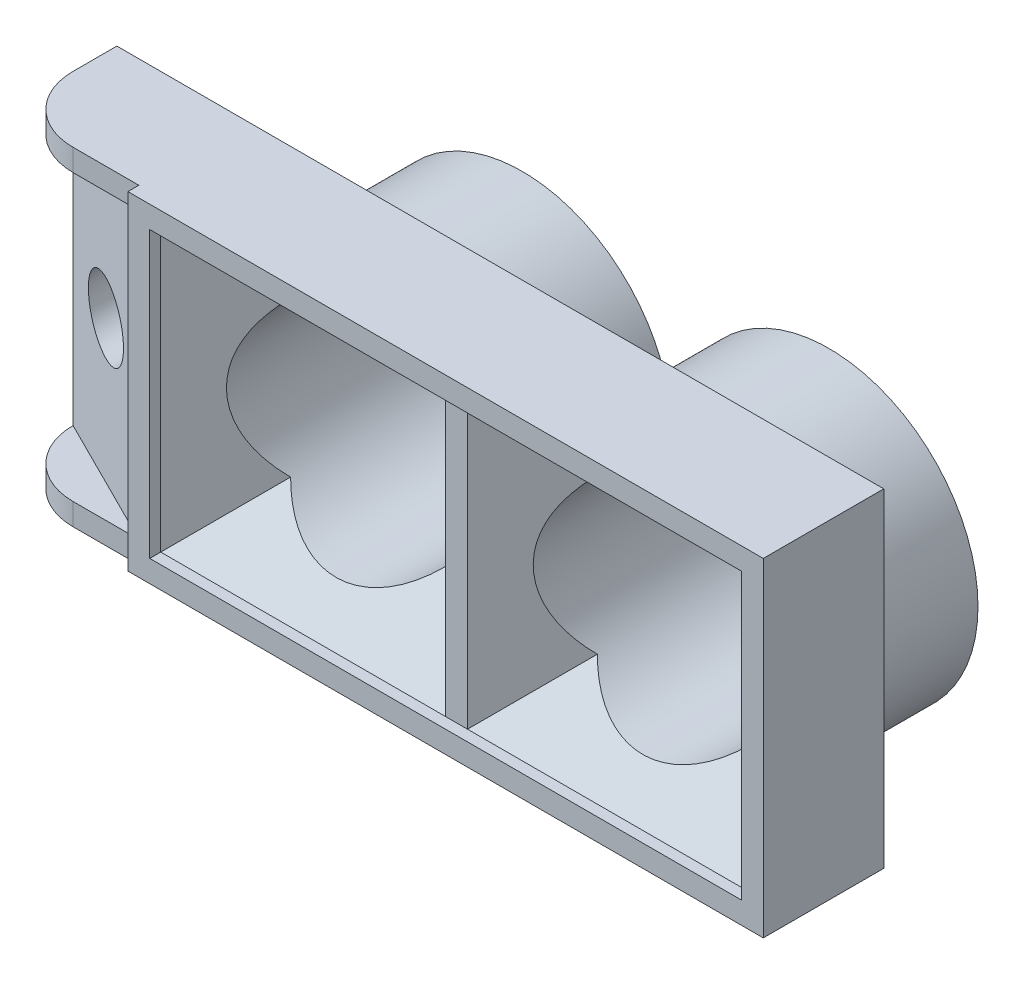
ISO-10303-21;
HEADER;
FILE_DESCRIPTION(('STEP AP214'),'2;1');
FILE_NAME('part.step','',(''),(''),'','','');
FILE_SCHEMA(('AUTOMOTIVE_DESIGN { 1 0 10303 214 1 1 1 1 }'));
ENDSEC;
DATA;
#1=APPLICATION_CONTEXT('core data for automotive mechanical design processes');
#2=APPLICATION_PROTOCOL_DEFINITION('international standard','automotive_design',2000,#1);
#3=PRODUCT_CONTEXT('',#1,'mechanical');
#4=PRODUCT('Part','Part','',(#3));
#5=PRODUCT_RELATED_PRODUCT_CATEGORY('part','',(#4));
#6=PRODUCT_DEFINITION_FORMATION('','',#4);
#7=PRODUCT_DEFINITION_CONTEXT('part definition',#1,'design');
#8=PRODUCT_DEFINITION('design','',#6,#7);
#9=PRODUCT_DEFINITION_SHAPE('','',#8);
#10=(LENGTH_UNIT() NAMED_UNIT(*) SI_UNIT(.MILLI.,.METRE.));
#11=(NAMED_UNIT(*) PLANE_ANGLE_UNIT() SI_UNIT($,.RADIAN.));
#12=(NAMED_UNIT(*) SI_UNIT($,.STERADIAN.) SOLID_ANGLE_UNIT());
#13=UNCERTAINTY_MEASURE_WITH_UNIT(LENGTH_MEASURE(1.E-05),#10,'distance_accuracy_value','');
#14=(GEOMETRIC_REPRESENTATION_CONTEXT(3) GLOBAL_UNCERTAINTY_ASSIGNED_CONTEXT((#13)) GLOBAL_UNIT_ASSIGNED_CONTEXT((#10,
#11,#12)) REPRESENTATION_CONTEXT('',''));
#15=CARTESIAN_POINT('',(0.,0.,0.));
#16=DIRECTION('',(0.,0.,1.));
#17=DIRECTION('',(1.,0.,0.));
#18=AXIS2_PLACEMENT_3D('',#15,#16,#17);
#19=CARTESIAN_POINT('',(0.,0.,5.));
#20=DIRECTION('',(0.,0.,-1.));
#21=DIRECTION('',(-1.,0.,0.));
#22=AXIS2_PLACEMENT_3D('',#19,#20,#21);
#23=PLANE('',#22);
#24=DIRECTION('',(0.,-1.,0.));
#25=VECTOR('',#24,1.);
#26=CARTESIAN_POINT('',(6.00222799526319,15.,5.));
#27=LINE('',#26,#25);
#28=CARTESIAN_POINT('',(6.00222799526319,15.,5.));
#29=VERTEX_POINT('',#28);
#30=CARTESIAN_POINT('',(6.00222799526319,0.,5.));
#31=VERTEX_POINT('',#30);
#32=EDGE_CURVE('E204',#29,#31,#27,.T.);
#33=ORIENTED_EDGE('',*,*,#32,.F.);
#34=DIRECTION('',(-1.,0.,0.));
#35=VECTOR('',#34,1.);
#36=CARTESIAN_POINT('',(0.,15.,5.));
#37=LINE('',#36,#35);
#38=CARTESIAN_POINT('',(3.,15.,5.));
#39=VERTEX_POINT('',#38);
#40=EDGE_CURVE('E363',#29,#39,#37,.T.);
#41=ORIENTED_EDGE('',*,*,#40,.T.);
#42=DIRECTION('',(0.,-1.,0.));
#43=VECTOR('',#42,1.);
#44=CARTESIAN_POINT('',(3.,0.,5.));
#45=LINE('',#44,#43);
#46=CARTESIAN_POINT('',(3.,14.,5.));
#47=VERTEX_POINT('',#46);
#48=EDGE_CURVE('E394',#39,#47,#45,.T.);
#49=ORIENTED_EDGE('',*,*,#48,.T.);
#50=DIRECTION('',(-1.,0.,0.));
#51=VECTOR('',#50,1.);
#52=CARTESIAN_POINT('',(0.,14.,5.));
#53=LINE('',#52,#51);
#54=CARTESIAN_POINT('',(6.,14.,5.));
#55=VERTEX_POINT('',#54);
#56=EDGE_CURVE('E323',#55,#47,#53,.T.);
#57=ORIENTED_EDGE('',*,*,#56,.F.);
#58=DIRECTION('',(0.,-1.,0.));
#59=VECTOR('',#58,1.);
#60=CARTESIAN_POINT('',(6.,0.,5.));
#61=LINE('',#60,#59);
#62=CARTESIAN_POINT('',(6.,0.999999999999999,5.));
#63=VERTEX_POINT('',#62);
#64=EDGE_CURVE('E319',#55,#63,#61,.T.);
#65=ORIENTED_EDGE('',*,*,#64,.T.);
#66=DIRECTION('',(1.,0.,0.));
#67=VECTOR('',#66,1.);
#68=CARTESIAN_POINT('',(0.,1.,5.));
#69=LINE('',#68,#67);
#70=CARTESIAN_POINT('',(3.,1.,5.));
#71=VERTEX_POINT('',#70);
#72=EDGE_CURVE('E327',#71,#63,#69,.T.);
#73=ORIENTED_EDGE('',*,*,#72,.F.);
#74=CARTESIAN_POINT('',(3.,0.,5.));
#75=VERTEX_POINT('',#74);
#76=EDGE_CURVE('E393',#71,#75,#45,.T.);
#77=ORIENTED_EDGE('',*,*,#76,.T.);
#78=DIRECTION('',(1.,0.,0.));
#79=VECTOR('',#78,1.);
#80=CARTESIAN_POINT('',(0.,0.,5.));
#81=LINE('',#80,#79);
#82=EDGE_CURVE('E59',#75,#31,#81,.T.);
#83=ORIENTED_EDGE('',*,*,#82,.T.);
#84=EDGE_LOOP('',(#33,#41,#49,#57,#65,#73,#77,#83));
#85=FACE_BOUND('',#84,.T.);
#86=ADVANCED_FACE('F41',(#85),#23,.F.);
#87=CARTESIAN_POINT('',(0.,1.,2.));
#88=DIRECTION('',(0.,-1.,0.));
#89=DIRECTION('',(1.,0.,0.));
#90=AXIS2_PLACEMENT_3D('',#87,#88,#89);
#91=PLANE('',#90);
#92=DIRECTION('',(-0.894427190999915,0.,-0.44721359549996));
#93=VECTOR('',#92,1.);
#94=CARTESIAN_POINT('',(0.,1.,1.99999999999998));
#95=LINE('',#94,#93);
#96=CARTESIAN_POINT('',(0.,1.,1.99999999999998));
#97=VERTEX_POINT('',#96);
#98=EDGE_CURVE('E268',#63,#97,#95,.T.);
#99=ORIENTED_EDGE('',*,*,#98,.T.);
#100=CARTESIAN_POINT('',(3.,1.,2.));
#101=DIRECTION('',(0.,-1.,0.));
#102=DIRECTION('',(1.,0.,0.));
#103=AXIS2_PLACEMENT_3D('',#100,#101,#102);
#104=CIRCLE('',#103,3.);
#105=EDGE_CURVE('E412',#97,#71,#104,.F.);
#106=ORIENTED_EDGE('',*,*,#105,.T.);
#107=ORIENTED_EDGE('',*,*,#72,.T.);
#108=EDGE_LOOP('',(#99,#106,#107));
#109=FACE_BOUND('',#108,.T.);
#110=ADVANCED_FACE('F496',(#109),#91,.F.);
#111=CARTESIAN_POINT('',(0.,14.,2.));
#112=DIRECTION('',(0.,1.,0.));
#113=DIRECTION('',(-1.,0.,0.));
#114=AXIS2_PLACEMENT_3D('',#111,#112,#113);
#115=PLANE('',#114);
#116=DIRECTION('',(-0.894427190999915,0.,-0.44721359549996));
#117=VECTOR('',#116,1.);
#118=CARTESIAN_POINT('',(0.,14.,1.99999999999998));
#119=LINE('',#118,#117);
#120=CARTESIAN_POINT('',(0.,14.,2.));
#121=VERTEX_POINT('',#120);
#122=EDGE_CURVE('E264',#55,#121,#119,.T.);
#123=ORIENTED_EDGE('',*,*,#122,.F.);
#124=ORIENTED_EDGE('',*,*,#56,.T.);
#125=CARTESIAN_POINT('',(3.,14.,2.));
#126=DIRECTION('',(0.,1.,0.));
#127=DIRECTION('',(-1.,0.,0.));
#128=AXIS2_PLACEMENT_3D('',#125,#126,#127);
#129=CIRCLE('',#128,3.);
#130=EDGE_CURVE('E409',#47,#121,#129,.F.);
#131=ORIENTED_EDGE('',*,*,#130,.T.);
#132=EDGE_LOOP('',(#123,#124,#131));
#133=FACE_BOUND('',#132,.T.);
#134=ADVANCED_FACE('F501',(#133),#115,.F.);
#135=CARTESIAN_POINT('',(0.,0.,0.));
#136=DIRECTION('',(0.,0.,-1.));
#137=DIRECTION('',(-1.,0.,0.));
#138=AXIS2_PLACEMENT_3D('',#135,#136,#137);
#139=PLANE('',#138);
#140=CARTESIAN_POINT('',(3.,7.5,0.));
#141=DIRECTION('',(0.,0.,-1.));
#142=DIRECTION('',(-1.,0.,0.));
#143=AXIS2_PLACEMENT_3D('',#140,#141,#142);
#144=CIRCLE('',#143,1.6);
#145=CARTESIAN_POINT('',(1.4,7.5,0.));
#146=VERTEX_POINT('',#145);
#147=EDGE_CURVE('E256',#146,#146,#144,.T.);
#148=ORIENTED_EDGE('',*,*,#147,.F.);
#149=EDGE_LOOP('',(#148));
#150=FACE_BOUND('',#149,.T.);
#151=DIRECTION('',(0.,-1.,0.));
#152=VECTOR('',#151,1.);
#153=CARTESIAN_POINT('',(0.,0.,0.));
#154=LINE('',#153,#152);
#155=CARTESIAN_POINT('',(0.,15.,0.));
#156=VERTEX_POINT('',#155);
#157=CARTESIAN_POINT('',(0.,0.,0.));
#158=VERTEX_POINT('',#157);
#159=EDGE_CURVE('E330',#156,#158,#154,.T.);
#160=ORIENTED_EDGE('',*,*,#159,.F.);
#161=DIRECTION('',(-1.,0.,0.));
#162=VECTOR('',#161,1.);
#163=CARTESIAN_POINT('',(0.,15.,0.));
#164=LINE('',#163,#162);
#165=CARTESIAN_POINT('',(35.,15.,0.));
#166=VERTEX_POINT('',#165);
#167=EDGE_CURVE('E364',#166,#156,#164,.T.);
#168=ORIENTED_EDGE('',*,*,#167,.F.);
#169=DIRECTION('',(0.,1.,0.));
#170=VECTOR('',#169,1.);
#171=CARTESIAN_POINT('',(35.,0.,0.));
#172=LINE('',#171,#170);
#173=CARTESIAN_POINT('',(35.,0.,0.));
#174=VERTEX_POINT('',#173);
#175=EDGE_CURVE('E374',#174,#166,#172,.T.);
#176=ORIENTED_EDGE('',*,*,#175,.F.);
#177=DIRECTION('',(1.,0.,0.));
#178=VECTOR('',#177,1.);
#179=CARTESIAN_POINT('',(0.,0.,0.));
#180=LINE('',#179,#178);
#181=EDGE_CURVE('E371',#158,#174,#180,.T.);
#182=ORIENTED_EDGE('',*,*,#181,.F.);
#183=EDGE_LOOP('',(#160,#168,#176,#182));
#184=FACE_BOUND('',#183,.T.);
#185=CARTESIAN_POINT('',(27.5,7.5,0.));
#186=DIRECTION('',(0.,0.,-1.));
#187=DIRECTION('',(-1.,0.,0.));
#188=AXIS2_PLACEMENT_3D('',#185,#186,#187);
#189=CIRCLE('',#188,6.8);
#190=CARTESIAN_POINT('',(20.7,7.5,0.));
#191=VERTEX_POINT('',#190);
#192=EDGE_CURVE('E11',#191,#191,#189,.T.);
#193=ORIENTED_EDGE('',*,*,#192,.F.);
#194=EDGE_LOOP('',(#193));
#195=FACE_BOUND('',#194,.T.);
#196=CARTESIAN_POINT('',(13.5,7.5,0.));
#197=DIRECTION('',(0.,0.,-1.));
#198=DIRECTION('',(-1.,0.,0.));
#199=AXIS2_PLACEMENT_3D('',#196,#197,#198);
#200=CIRCLE('',#199,6.8);
#201=CARTESIAN_POINT('',(6.7,7.5,0.));
#202=VERTEX_POINT('',#201);
#203=EDGE_CURVE('E276',#202,#202,#200,.T.);
#204=ORIENTED_EDGE('',*,*,#203,.F.);
#205=EDGE_LOOP('',(#204));
#206=FACE_BOUND('',#205,.T.);
#207=ADVANCED_FACE('F516',(#150,#184,#195,#206),#139,.T.);
#208=CARTESIAN_POINT('',(3.,0.,2.));
#209=DIRECTION('',(0.,-1.,0.));
#210=DIRECTION('',(0.,0.,-1.));
#211=AXIS2_PLACEMENT_3D('',#208,#209,#210);
#212=CYLINDRICAL_SURFACE('',#211,3.);
#213=DIRECTION('',(0.,-1.,0.));
#214=VECTOR('',#213,1.);
#215=CARTESIAN_POINT('',(0.,0.,2.));
#216=LINE('',#215,#214);
#217=CARTESIAN_POINT('',(0.,15.,2.));
#218=VERTEX_POINT('',#217);
#219=EDGE_CURVE('E401',#121,#218,#216,.F.);
#220=ORIENTED_EDGE('',*,*,#219,.F.);
#221=ORIENTED_EDGE('',*,*,#130,.F.);
#222=ORIENTED_EDGE('',*,*,#48,.F.);
#223=CARTESIAN_POINT('',(3.,15.,2.));
#224=DIRECTION('',(0.,-1.,0.));
#225=DIRECTION('',(0.,0.,-1.));
#226=AXIS2_PLACEMENT_3D('',#223,#224,#225);
#227=CIRCLE('',#226,3.);
#228=EDGE_CURVE('E405',#218,#39,#227,.F.);
#229=ORIENTED_EDGE('',*,*,#228,.F.);
#230=EDGE_LOOP('',(#220,#221,#222,#229));
#231=FACE_BOUND('',#230,.T.);
#232=ADVANCED_FACE('F508',(#231),#212,.T.);
#233=DIRECTION('',(0.,-1.,0.));
#234=VECTOR('',#233,1.);
#235=CARTESIAN_POINT('',(20.,0.,5.));
#236=LINE('',#235,#234);
#237=CARTESIAN_POINT('',(20.,14.,5.));
#238=VERTEX_POINT('',#237);
#239=CARTESIAN_POINT('',(20.,1.,5.));
#240=VERTEX_POINT('',#239);
#241=EDGE_CURVE('E331',#238,#240,#236,.T.);
#242=ORIENTED_EDGE('',*,*,#241,.T.);
#243=DIRECTION('',(1.,0.,0.));
#244=VECTOR('',#243,1.);
#245=CARTESIAN_POINT('',(21.,1.,5.));
#246=LINE('',#245,#244);
#247=CARTESIAN_POINT('',(21.,1.,5.));
#248=VERTEX_POINT('',#247);
#249=EDGE_CURVE('E218',#240,#248,#246,.T.);
#250=ORIENTED_EDGE('',*,*,#249,.T.);
#251=DIRECTION('',(0.,1.,0.));
#252=VECTOR('',#251,1.);
#253=CARTESIAN_POINT('',(21.,0.,5.));
#254=LINE('',#253,#252);
#255=CARTESIAN_POINT('',(21.,14.,5.));
#256=VERTEX_POINT('',#255);
#257=EDGE_CURVE('E345',#248,#256,#254,.T.);
#258=ORIENTED_EDGE('',*,*,#257,.T.);
#259=DIRECTION('',(-1.,0.,0.));
#260=VECTOR('',#259,1.);
#261=CARTESIAN_POINT('',(34.,14.,5.));
#262=LINE('',#261,#260);
#263=EDGE_CURVE('E195',#256,#238,#262,.T.);
#264=ORIENTED_EDGE('',*,*,#263,.T.);
#265=EDGE_LOOP('',(#242,#250,#258,#264));
#266=FACE_BOUND('',#265,.T.);
#267=ADVANCED_FACE('F458',(#266),#23,.F.);
#268=CARTESIAN_POINT('',(0.,0.,5.));
#269=DIRECTION('',(1.,0.,0.));
#270=DIRECTION('',(0.,0.,-1.));
#271=AXIS2_PLACEMENT_3D('',#268,#269,#270);
#272=PLANE('',#271);
#273=DIRECTION('',(0.,0.,-1.));
#274=VECTOR('',#273,1.);
#275=CARTESIAN_POINT('',(0.,0.,5.));
#276=LINE('',#275,#274);
#277=CARTESIAN_POINT('',(0.,0.,2.));
#278=VERTEX_POINT('',#277);
#279=EDGE_CURVE('E390',#278,#158,#276,.T.);
#280=ORIENTED_EDGE('',*,*,#279,.F.);
#281=EDGE_CURVE('E402',#278,#97,#216,.F.);
#282=ORIENTED_EDGE('',*,*,#281,.T.);
#283=DIRECTION('',(0.,-1.,0.));
#284=VECTOR('',#283,1.);
#285=CARTESIAN_POINT('',(0.,0.,2.));
#286=LINE('',#285,#284);
#287=EDGE_CURVE('E314',#121,#97,#286,.T.);
#288=ORIENTED_EDGE('',*,*,#287,.F.);
#289=ORIENTED_EDGE('',*,*,#219,.T.);
#290=DIRECTION('',(0.,0.,-1.));
#291=VECTOR('',#290,1.);
#292=CARTESIAN_POINT('',(0.,15.,5.));
#293=LINE('',#292,#291);
#294=EDGE_CURVE('E367',#218,#156,#293,.T.);
#295=ORIENTED_EDGE('',*,*,#294,.T.);
#296=ORIENTED_EDGE('',*,*,#159,.T.);
#297=EDGE_LOOP('',(#280,#282,#288,#289,#295,#296));
#298=FACE_BOUND('',#297,.T.);
#299=ADVANCED_FACE('F507',(#298),#272,.F.);
#300=CARTESIAN_POINT('',(0.,0.,5.));
#301=DIRECTION('',(0.,1.,0.));
#302=DIRECTION('',(0.,0.,1.));
#303=AXIS2_PLACEMENT_3D('',#300,#301,#302);
#304=PLANE('',#303);
#305=ORIENTED_EDGE('',*,*,#82,.F.);
#306=CARTESIAN_POINT('',(3.,0.,2.));
#307=DIRECTION('',(0.,1.,0.));
#308=DIRECTION('',(0.,0.,1.));
#309=AXIS2_PLACEMENT_3D('',#306,#307,#308);
#310=CIRCLE('',#309,3.);
#311=EDGE_CURVE('E398',#75,#278,#310,.F.);
#312=ORIENTED_EDGE('',*,*,#311,.T.);
#313=ORIENTED_EDGE('',*,*,#279,.T.);
#314=ORIENTED_EDGE('',*,*,#181,.T.);
#315=DIRECTION('',(0.,0.,-1.));
#316=VECTOR('',#315,1.);
#317=CARTESIAN_POINT('',(35.,0.,5.));
#318=LINE('',#317,#316);
#319=CARTESIAN_POINT('',(35.,0.,5.5));
#320=VERTEX_POINT('',#319);
#321=EDGE_CURVE('E386',#320,#174,#318,.T.);
#322=ORIENTED_EDGE('',*,*,#321,.F.);
#323=DIRECTION('',(1.,0.,0.));
#324=VECTOR('',#323,1.);
#325=CARTESIAN_POINT('',(6.00222799526319,0.,5.5));
#326=LINE('',#325,#324);
#327=CARTESIAN_POINT('',(6.00222799526319,0.,5.5));
#328=VERTEX_POINT('',#327);
#329=EDGE_CURVE('E242',#328,#320,#326,.T.);
#330=ORIENTED_EDGE('',*,*,#329,.F.);
#331=DIRECTION('',(0.,0.,-1.));
#332=VECTOR('',#331,1.);
#333=CARTESIAN_POINT('',(6.00222799526319,0.,5.5));
#334=LINE('',#333,#332);
#335=EDGE_CURVE('E246',#328,#31,#334,.T.);
#336=ORIENTED_EDGE('',*,*,#335,.T.);
#337=EDGE_LOOP('',(#305,#312,#313,#314,#322,#330,#336));
#338=FACE_BOUND('',#337,.T.);
#339=ADVANCED_FACE('F513',(#338),#304,.F.);
#340=CARTESIAN_POINT('',(35.,0.,5.));
#341=DIRECTION('',(-1.,0.,0.));
#342=DIRECTION('',(0.,0.,1.));
#343=AXIS2_PLACEMENT_3D('',#340,#341,#342);
#344=PLANE('',#343);
#345=ORIENTED_EDGE('',*,*,#175,.T.);
#346=DIRECTION('',(0.,0.,-1.));
#347=VECTOR('',#346,1.);
#348=CARTESIAN_POINT('',(35.,15.,5.));
#349=LINE('',#348,#347);
#350=CARTESIAN_POINT('',(35.,15.,5.5));
#351=VERTEX_POINT('',#350);
#352=EDGE_CURVE('E382',#351,#166,#349,.T.);
#353=ORIENTED_EDGE('',*,*,#352,.F.);
#354=DIRECTION('',(0.,1.,0.));
#355=VECTOR('',#354,1.);
#356=CARTESIAN_POINT('',(35.,0.,5.5));
#357=LINE('',#356,#355);
#358=EDGE_CURVE('E232',#320,#351,#357,.T.);
#359=ORIENTED_EDGE('',*,*,#358,.F.);
#360=ORIENTED_EDGE('',*,*,#321,.T.);
#361=EDGE_LOOP('',(#345,#353,#359,#360));
#362=FACE_BOUND('',#361,.T.);
#363=ADVANCED_FACE('F534',(#362),#344,.F.);
#364=CARTESIAN_POINT('',(0.,15.,5.));
#365=DIRECTION('',(0.,-1.,0.));
#366=DIRECTION('',(0.,0.,-1.));
#367=AXIS2_PLACEMENT_3D('',#364,#365,#366);
#368=PLANE('',#367);
#369=ORIENTED_EDGE('',*,*,#294,.F.);
#370=ORIENTED_EDGE('',*,*,#228,.T.);
#371=ORIENTED_EDGE('',*,*,#40,.F.);
#372=DIRECTION('',(0.,0.,-1.));
#373=VECTOR('',#372,1.);
#374=CARTESIAN_POINT('',(6.00222799526319,15.,5.5));
#375=LINE('',#374,#373);
#376=CARTESIAN_POINT('',(6.00222799526319,15.,5.5));
#377=VERTEX_POINT('',#376);
#378=EDGE_CURVE('E252',#377,#29,#375,.T.);
#379=ORIENTED_EDGE('',*,*,#378,.F.);
#380=DIRECTION('',(-1.,0.,0.));
#381=VECTOR('',#380,1.);
#382=CARTESIAN_POINT('',(35.,15.,5.5));
#383=LINE('',#382,#381);
#384=EDGE_CURVE('E236',#351,#377,#383,.T.);
#385=ORIENTED_EDGE('',*,*,#384,.F.);
#386=ORIENTED_EDGE('',*,*,#352,.T.);
#387=ORIENTED_EDGE('',*,*,#167,.T.);
#388=EDGE_LOOP('',(#369,#370,#371,#379,#385,#386,#387));
#389=FACE_BOUND('',#388,.T.);
#390=ADVANCED_FACE('F527',(#389),#368,.F.);
#391=ORIENTED_EDGE('',*,*,#105,.F.);
#392=ORIENTED_EDGE('',*,*,#281,.F.);
#393=ORIENTED_EDGE('',*,*,#311,.F.);
#394=ORIENTED_EDGE('',*,*,#76,.F.);
#395=EDGE_LOOP('',(#391,#392,#393,#394));
#396=FACE_BOUND('',#395,.T.);
#397=ADVANCED_FACE('F519',(#396),#212,.T.);
#398=CARTESIAN_POINT('',(0.,11.,2.));
#399=DIRECTION('',(0.,0.707106781186544,-0.707106781186551));
#400=DIRECTION('',(-1.,0.,0.));
#401=AXIS2_PLACEMENT_3D('',#398,#399,#400);
#402=PLANE('',#401);
#403=DIRECTION('',(-0.577350269189628,0.577350269189628,0.577350269189622));
#404=VECTOR('',#403,1.);
#405=CARTESIAN_POINT('',(25.6666666666667,9.3333333333333,0.333333333333335));
#406=LINE('',#405,#404);
#407=CARTESIAN_POINT('',(23.9644660940673,11.0355339059327,2.03553390593275));
#408=VERTEX_POINT('',#407);
#409=EDGE_CURVE('E350',#408,#256,#406,.T.);
#410=ORIENTED_EDGE('',*,*,#409,.F.);
#411=CARTESIAN_POINT('',(27.5,7.5,-1.49999999999995));
#412=DIRECTION('',(0.,0.707106781186544,-0.707106781186551));
#413=DIRECTION('',(0.,0.707106781186551,0.707106781186544));
#414=AXIS2_PLACEMENT_3D('',#411,#412,#413);
#415=ELLIPSE('',#414,7.07106781186543,5.);
#416=CARTESIAN_POINT('',(31.0355339059327,11.0355339059327,2.03553390593275));
#417=VERTEX_POINT('',#416);
#418=EDGE_CURVE('E310',#408,#417,#415,.T.);
#419=ORIENTED_EDGE('',*,*,#418,.T.);
#420=DIRECTION('',(0.577350269189628,0.577350269189628,0.577350269189622));
#421=VECTOR('',#420,1.);
#422=CARTESIAN_POINT('',(27.3333333333333,7.3333333333333,-1.66666666666665));
#423=LINE('',#422,#421);
#424=CARTESIAN_POINT('',(34.,14.,5.));
#425=VERTEX_POINT('',#424);
#426=EDGE_CURVE('E425',#425,#417,#423,.F.);
#427=ORIENTED_EDGE('',*,*,#426,.F.);
#428=DIRECTION('',(-1.,0.,0.));
#429=VECTOR('',#428,1.);
#430=CARTESIAN_POINT('',(0.,14.,5.));
#431=LINE('',#430,#429);
#432=EDGE_CURVE('E336',#425,#256,#431,.T.);
#433=ORIENTED_EDGE('',*,*,#432,.T.);
#434=EDGE_LOOP('',(#410,#419,#427,#433));
#435=FACE_BOUND('',#434,.T.);
#436=ADVANCED_FACE('F462',(#435),#402,.F.);
#437=CARTESIAN_POINT('',(21.,0.,4.99999999999999));
#438=DIRECTION('',(0.707106781186544,0.,0.707106781186551));
#439=DIRECTION('',(0.,-1.,0.));
#440=AXIS2_PLACEMENT_3D('',#437,#438,#439);
#441=PLANE('',#440);
#442=DIRECTION('',(-0.577350269189628,-0.577350269189628,0.577350269189622));
#443=VECTOR('',#442,1.);
#444=CARTESIAN_POINT('',(16.,-4.00000000000004,9.99999999999998));
#445=LINE('',#444,#443);
#446=CARTESIAN_POINT('',(23.9644660940673,3.96446609406727,2.03553390593275));
#447=VERTEX_POINT('',#446);
#448=EDGE_CURVE('E420',#447,#248,#445,.T.);
#449=ORIENTED_EDGE('',*,*,#448,.F.);
#450=CARTESIAN_POINT('',(27.5,7.5,-1.49999999999995));
#451=DIRECTION('',(0.707106781186544,0.,0.707106781186551));
#452=DIRECTION('',(-0.707106781186551,0.,0.707106781186544));
#453=AXIS2_PLACEMENT_3D('',#450,#451,#452);
#454=ELLIPSE('',#453,7.07106781186543,5.);
#455=EDGE_CURVE('E67',#447,#408,#454,.F.);
#456=ORIENTED_EDGE('',*,*,#455,.T.);
#457=ORIENTED_EDGE('',*,*,#409,.T.);
#458=ORIENTED_EDGE('',*,*,#257,.F.);
#459=EDGE_LOOP('',(#449,#456,#457,#458));
#460=FACE_BOUND('',#459,.T.);
#461=ADVANCED_FACE('F455',(#460),#441,.T.);
#462=CARTESIAN_POINT('',(31.,0.,2.));
#463=DIRECTION('',(0.707106781186544,0.,-0.707106781186551));
#464=DIRECTION('',(0.,1.,0.));
#465=AXIS2_PLACEMENT_3D('',#462,#463,#464);
#466=PLANE('',#465);
#467=ORIENTED_EDGE('',*,*,#426,.T.);
#468=CARTESIAN_POINT('',(27.5,7.5,-1.49999999999995));
#469=DIRECTION('',(0.707106781186544,0.,-0.707106781186551));
#470=DIRECTION('',(0.707106781186551,0.,0.707106781186544));
#471=AXIS2_PLACEMENT_3D('',#468,#469,#470);
#472=ELLIPSE('',#471,7.07106781186543,5.);
#473=CARTESIAN_POINT('',(31.0355339059327,3.96446609406726,2.03553390593276));
#474=VERTEX_POINT('',#473);
#475=EDGE_CURVE('E304',#417,#474,#472,.T.);
#476=ORIENTED_EDGE('',*,*,#475,.T.);
#477=DIRECTION('',(0.577350269189628,-0.577350269189628,0.577350269189622));
#478=VECTOR('',#477,1.);
#479=CARTESIAN_POINT('',(20.6666666666666,14.3333333333334,-8.33333333333329));
#480=LINE('',#479,#478);
#481=CARTESIAN_POINT('',(34.,1.,5.));
#482=VERTEX_POINT('',#481);
#483=EDGE_CURVE('E416',#482,#474,#480,.F.);
#484=ORIENTED_EDGE('',*,*,#483,.F.);
#485=DIRECTION('',(0.,1.,0.));
#486=VECTOR('',#485,1.);
#487=CARTESIAN_POINT('',(34.,0.,5.));
#488=LINE('',#487,#486);
#489=EDGE_CURVE('E354',#482,#425,#488,.T.);
#490=ORIENTED_EDGE('',*,*,#489,.T.);
#491=EDGE_LOOP('',(#467,#476,#484,#490));
#492=FACE_BOUND('',#491,.T.);
#493=ADVANCED_FACE('F475',(#492),#466,.F.);
#494=CARTESIAN_POINT('',(0.,4.00000000000002,2.));
#495=DIRECTION('',(0.,-0.707106781186544,-0.707106781186551));
#496=DIRECTION('',(1.,0.,0.));
#497=AXIS2_PLACEMENT_3D('',#494,#495,#496);
#498=PLANE('',#497);
#499=ORIENTED_EDGE('',*,*,#483,.T.);
#500=CARTESIAN_POINT('',(27.5,7.5,-1.49999999999995));
#501=DIRECTION('',(0.,-0.707106781186544,-0.707106781186551));
#502=DIRECTION('',(0.,-0.707106781186551,0.707106781186544));
#503=AXIS2_PLACEMENT_3D('',#500,#501,#502);
#504=ELLIPSE('',#503,7.07106781186543,5.);
#505=EDGE_CURVE('E46',#474,#447,#504,.T.);
#506=ORIENTED_EDGE('',*,*,#505,.T.);
#507=ORIENTED_EDGE('',*,*,#448,.T.);
#508=DIRECTION('',(1.,0.,0.));
#509=VECTOR('',#508,1.);
#510=CARTESIAN_POINT('',(0.,1.00000000000001,5.));
#511=LINE('',#510,#509);
#512=EDGE_CURVE('E349',#248,#482,#511,.T.);
#513=ORIENTED_EDGE('',*,*,#512,.T.);
#514=EDGE_LOOP('',(#499,#506,#507,#513));
#515=FACE_BOUND('',#514,.T.);
#516=ADVANCED_FACE('F451',(#515),#498,.F.);
#517=CARTESIAN_POINT('',(0.,11.,2.));
#518=DIRECTION('',(0.,0.707106781186544,-0.707106781186551));
#519=DIRECTION('',(-1.,0.,0.));
#520=AXIS2_PLACEMENT_3D('',#517,#518,#519);
#521=PLANE('',#520);
#522=DIRECTION('',(0.577350269189628,-0.577350269189628,-0.577350269189622));
#523=VECTOR('',#522,1.);
#524=CARTESIAN_POINT('',(13.6666666666667,7.3333333333333,-1.66666666666665));
#525=LINE('',#524,#523);
#526=CARTESIAN_POINT('',(9.96446609406726,11.0355339059327,2.03553390593275));
#527=VERTEX_POINT('',#526);
#528=CARTESIAN_POINT('',(7.,14.,5.));
#529=VERTEX_POINT('',#528);
#530=EDGE_CURVE('E421',#527,#529,#525,.F.);
#531=ORIENTED_EDGE('',*,*,#530,.F.);
#532=CARTESIAN_POINT('',(13.5,7.5,-1.49999999999995));
#533=DIRECTION('',(0.,0.707106781186544,-0.707106781186551));
#534=DIRECTION('',(0.,0.707106781186551,0.707106781186544));
#535=AXIS2_PLACEMENT_3D('',#532,#533,#534);
#536=ELLIPSE('',#535,7.07106781186544,5.);
#537=CARTESIAN_POINT('',(17.0355339059327,11.0355339059327,2.03553390593275));
#538=VERTEX_POINT('',#537);
#539=EDGE_CURVE('E300',#527,#538,#536,.T.);
#540=ORIENTED_EDGE('',*,*,#539,.T.);
#541=DIRECTION('',(-0.577350269189628,-0.577350269189628,-0.577350269189622));
#542=VECTOR('',#541,1.);
#543=CARTESIAN_POINT('',(15.3333333333333,9.3333333333333,0.333333333333328));
#544=LINE('',#543,#542);
#545=EDGE_CURVE('E439',#238,#538,#544,.T.);
#546=ORIENTED_EDGE('',*,*,#545,.F.);
#547=DIRECTION('',(-1.,0.,0.));
#548=VECTOR('',#547,1.);
#549=CARTESIAN_POINT('',(0.,14.,5.));
#550=LINE('',#549,#548);
#551=EDGE_CURVE('E335',#238,#529,#550,.T.);
#552=ORIENTED_EDGE('',*,*,#551,.T.);
#553=EDGE_LOOP('',(#531,#540,#546,#552));
#554=FACE_BOUND('',#553,.T.);
#555=ADVANCED_FACE('F44',(#554),#521,.F.);
#556=CARTESIAN_POINT('',(10.,0.,2.));
#557=DIRECTION('',(-0.707106781186544,0.,-0.707106781186551));
#558=DIRECTION('',(0.,-1.,0.));
#559=AXIS2_PLACEMENT_3D('',#556,#557,#558);
#560=PLANE('',#559);
#561=DIRECTION('',(0.577350269189628,0.577350269189628,-0.577350269189622));
#562=VECTOR('',#561,1.);
#563=CARTESIAN_POINT('',(6.66666666666665,0.666666666666648,5.33333333333333));
#564=LINE('',#563,#562);
#565=CARTESIAN_POINT('',(9.96446609406726,3.96446609406726,2.03553390593275));
#566=VERTEX_POINT('',#565);
#567=CARTESIAN_POINT('',(7.,0.999999999999999,5.));
#568=VERTEX_POINT('',#567);
#569=EDGE_CURVE('E435',#566,#568,#564,.F.);
#570=ORIENTED_EDGE('',*,*,#569,.F.);
#571=CARTESIAN_POINT('',(13.5,7.5,-1.49999999999995));
#572=DIRECTION('',(-0.707106781186544,0.,-0.707106781186551));
#573=DIRECTION('',(-0.707106781186551,0.,0.707106781186544));
#574=AXIS2_PLACEMENT_3D('',#571,#572,#573);
#575=ELLIPSE('',#574,7.07106781186544,5.);
#576=EDGE_CURVE('E296',#566,#527,#575,.T.);
#577=ORIENTED_EDGE('',*,*,#576,.T.);
#578=ORIENTED_EDGE('',*,*,#530,.T.);
#579=DIRECTION('',(0.,-1.,0.));
#580=VECTOR('',#579,1.);
#581=CARTESIAN_POINT('',(7.,0.,5.));
#582=LINE('',#581,#580);
#583=EDGE_CURVE('E202',#529,#568,#582,.T.);
#584=ORIENTED_EDGE('',*,*,#583,.T.);
#585=EDGE_LOOP('',(#570,#577,#578,#584));
#586=FACE_BOUND('',#585,.T.);
#587=ADVANCED_FACE('F763',(#586),#560,.F.);
#588=CARTESIAN_POINT('',(20.,0.,4.99999999999998));
#589=DIRECTION('',(-0.707106781186544,0.,0.707106781186551));
#590=DIRECTION('',(0.,1.,0.));
#591=AXIS2_PLACEMENT_3D('',#588,#589,#590);
#592=PLANE('',#591);
#593=ORIENTED_EDGE('',*,*,#545,.T.);
#594=CARTESIAN_POINT('',(13.5,7.5,-1.49999999999995));
#595=DIRECTION('',(-0.707106781186544,0.,0.707106781186551));
#596=DIRECTION('',(0.707106781186551,0.,0.707106781186544));
#597=AXIS2_PLACEMENT_3D('',#594,#595,#596);
#598=ELLIPSE('',#597,7.07106781186544,5.);
#599=CARTESIAN_POINT('',(17.0355339059327,3.96446609406726,2.03553390593275));
#600=VERTEX_POINT('',#599);
#601=EDGE_CURVE('E291',#538,#600,#598,.F.);
#602=ORIENTED_EDGE('',*,*,#601,.T.);
#603=DIRECTION('',(-0.577350269189628,0.577350269189628,-0.577350269189622));
#604=VECTOR('',#603,1.);
#605=CARTESIAN_POINT('',(11.3333333333333,9.66666666666671,-3.66666666666664));
#606=LINE('',#605,#604);
#607=EDGE_CURVE('E318',#240,#600,#606,.T.);
#608=ORIENTED_EDGE('',*,*,#607,.F.);
#609=ORIENTED_EDGE('',*,*,#241,.F.);
#610=EDGE_LOOP('',(#593,#602,#608,#609));
#611=FACE_BOUND('',#610,.T.);
#612=ADVANCED_FACE('F468',(#611),#592,.T.);
#613=CARTESIAN_POINT('',(0.,4.00000000000001,2.));
#614=DIRECTION('',(0.,-0.707106781186544,-0.707106781186551));
#615=DIRECTION('',(1.,0.,0.));
#616=AXIS2_PLACEMENT_3D('',#613,#614,#615);
#617=PLANE('',#616);
#618=ORIENTED_EDGE('',*,*,#607,.T.);
#619=CARTESIAN_POINT('',(13.5,7.5,-1.49999999999995));
#620=DIRECTION('',(0.,-0.707106781186544,-0.707106781186551));
#621=DIRECTION('',(0.,-0.707106781186551,0.707106781186544));
#622=AXIS2_PLACEMENT_3D('',#619,#620,#621);
#623=ELLIPSE('',#622,7.07106781186544,5.);
#624=EDGE_CURVE('E415',#600,#566,#623,.T.);
#625=ORIENTED_EDGE('',*,*,#624,.T.);
#626=ORIENTED_EDGE('',*,*,#569,.T.);
#627=DIRECTION('',(1.,0.,0.));
#628=VECTOR('',#627,1.);
#629=CARTESIAN_POINT('',(0.,0.999999999999997,5.));
#630=LINE('',#629,#628);
#631=EDGE_CURVE('E324',#568,#240,#630,.T.);
#632=ORIENTED_EDGE('',*,*,#631,.T.);
#633=EDGE_LOOP('',(#618,#625,#626,#632));
#634=FACE_BOUND('',#633,.T.);
#635=ADVANCED_FACE('F469',(#634),#617,.F.);
#636=CARTESIAN_POINT('',(13.5,7.5,-3.));
#637=DIRECTION('',(0.,0.,1.));
#638=DIRECTION('',(1.,0.,0.));
#639=AXIS2_PLACEMENT_3D('',#636,#637,#638);
#640=CYLINDRICAL_SURFACE('',#639,5.);
#641=ORIENTED_EDGE('',*,*,#576,.F.);
#642=ORIENTED_EDGE('',*,*,#624,.F.);
#643=ORIENTED_EDGE('',*,*,#601,.F.);
#644=ORIENTED_EDGE('',*,*,#539,.F.);
#645=EDGE_LOOP('',(#641,#642,#643,#644));
#646=FACE_BOUND('',#645,.T.);
#647=CARTESIAN_POINT('',(13.5,7.5,-5.));
#648=DIRECTION('',(0.,0.,-1.));
#649=DIRECTION('',(-1.,0.,0.));
#650=AXIS2_PLACEMENT_3D('',#647,#648,#649);
#651=CIRCLE('',#650,5.);
#652=CARTESIAN_POINT('',(8.5,7.5,-5.));
#653=VERTEX_POINT('',#652);
#654=EDGE_CURVE('E272',#653,#653,#651,.T.);
#655=ORIENTED_EDGE('',*,*,#654,.T.);
#656=EDGE_LOOP('',(#655));
#657=FACE_BOUND('',#656,.T.);
#658=ADVANCED_FACE('F480',(#646,#657),#640,.F.);
#659=CARTESIAN_POINT('',(27.5,7.5,-3.));
#660=DIRECTION('',(0.,0.,1.));
#661=DIRECTION('',(1.,0.,0.));
#662=AXIS2_PLACEMENT_3D('',#659,#660,#661);
#663=CYLINDRICAL_SURFACE('',#662,5.);
#664=ORIENTED_EDGE('',*,*,#455,.F.);
#665=ORIENTED_EDGE('',*,*,#505,.F.);
#666=ORIENTED_EDGE('',*,*,#475,.F.);
#667=ORIENTED_EDGE('',*,*,#418,.F.);
#668=EDGE_LOOP('',(#664,#665,#666,#667));
#669=FACE_BOUND('',#668,.T.);
#670=CARTESIAN_POINT('',(27.5,7.5,-5.));
#671=DIRECTION('',(0.,0.,-1.));
#672=DIRECTION('',(-1.,0.,0.));
#673=AXIS2_PLACEMENT_3D('',#670,#671,#672);
#674=CIRCLE('',#673,5.);
#675=CARTESIAN_POINT('',(22.5,7.5,-5.));
#676=VERTEX_POINT('',#675);
#677=EDGE_CURVE('E281',#676,#676,#674,.T.);
#678=ORIENTED_EDGE('',*,*,#677,.T.);
#679=EDGE_LOOP('',(#678));
#680=FACE_BOUND('',#679,.T.);
#681=ADVANCED_FACE('F476',(#669,#680),#663,.F.);
#682=CARTESIAN_POINT('',(27.5,7.5,-5.));
#683=DIRECTION('',(0.,0.,-1.));
#684=DIRECTION('',(-1.,0.,0.));
#685=AXIS2_PLACEMENT_3D('',#682,#683,#684);
#686=PLANE('',#685);
#687=CARTESIAN_POINT('',(27.5,7.5,-5.));
#688=DIRECTION('',(0.,0.,-1.));
#689=DIRECTION('',(-1.,0.,0.));
#690=AXIS2_PLACEMENT_3D('',#687,#688,#689);
#691=CIRCLE('',#690,6.8);
#692=CARTESIAN_POINT('',(20.7,7.5,-5.));
#693=VERTEX_POINT('',#692);
#694=EDGE_CURVE('E288',#693,#693,#691,.T.);
#695=ORIENTED_EDGE('',*,*,#694,.T.);
#696=EDGE_LOOP('',(#695));
#697=FACE_BOUND('',#696,.T.);
#698=ORIENTED_EDGE('',*,*,#677,.F.);
#699=EDGE_LOOP('',(#698));
#700=FACE_BOUND('',#699,.T.);
#701=ADVANCED_FACE('F479',(#697,#700),#686,.T.);
#702=CARTESIAN_POINT('',(27.5,7.5,-5.));
#703=DIRECTION('',(0.,0.,1.));
#704=DIRECTION('',(1.,0.,0.));
#705=AXIS2_PLACEMENT_3D('',#702,#703,#704);
#706=CYLINDRICAL_SURFACE('',#705,6.8);
#707=ORIENTED_EDGE('',*,*,#694,.F.);
#708=EDGE_LOOP('',(#707));
#709=FACE_BOUND('',#708,.T.);
#710=ORIENTED_EDGE('',*,*,#192,.T.);
#711=EDGE_LOOP('',(#710));
#712=FACE_BOUND('',#711,.T.);
#713=ADVANCED_FACE('F485',(#709,#712),#706,.T.);
#714=CARTESIAN_POINT('',(13.5,7.5,-5.));
#715=DIRECTION('',(0.,0.,-1.));
#716=DIRECTION('',(-1.,0.,0.));
#717=AXIS2_PLACEMENT_3D('',#714,#715,#716);
#718=PLANE('',#717);
#719=CARTESIAN_POINT('',(13.5,7.5,-5.));
#720=DIRECTION('',(0.,0.,-1.));
#721=DIRECTION('',(-1.,0.,0.));
#722=AXIS2_PLACEMENT_3D('',#719,#720,#721);
#723=CIRCLE('',#722,6.8);
#724=CARTESIAN_POINT('',(6.7,7.5,-5.));
#725=VERTEX_POINT('',#724);
#726=EDGE_CURVE('E277',#725,#725,#723,.T.);
#727=ORIENTED_EDGE('',*,*,#726,.T.);
#728=EDGE_LOOP('',(#727));
#729=FACE_BOUND('',#728,.T.);
#730=ORIENTED_EDGE('',*,*,#654,.F.);
#731=EDGE_LOOP('',(#730));
#732=FACE_BOUND('',#731,.T.);
#733=ADVANCED_FACE('F491',(#729,#732),#718,.T.);
#734=CARTESIAN_POINT('',(13.5,7.5,-5.));
#735=DIRECTION('',(0.,0.,1.));
#736=DIRECTION('',(1.,0.,0.));
#737=AXIS2_PLACEMENT_3D('',#734,#735,#736);
#738=CYLINDRICAL_SURFACE('',#737,6.8);
#739=ORIENTED_EDGE('',*,*,#726,.F.);
#740=EDGE_LOOP('',(#739));
#741=FACE_BOUND('',#740,.T.);
#742=ORIENTED_EDGE('',*,*,#203,.T.);
#743=EDGE_LOOP('',(#742));
#744=FACE_BOUND('',#743,.T.);
#745=ADVANCED_FACE('F587',(#741,#744),#738,.T.);
#746=CARTESIAN_POINT('',(0.,-5.70820393249937,1.99999999999998));
#747=DIRECTION('',(0.44721359549996,0.,-0.894427190999915));
#748=DIRECTION('',(-0.894427190999915,0.,-0.44721359549996));
#749=AXIS2_PLACEMENT_3D('',#746,#747,#748);
#750=PLANE('',#749);
#751=CARTESIAN_POINT('',(3.,7.5,3.49999999999999));
#752=DIRECTION('',(0.44721359549996,0.,-0.894427190999915));
#753=DIRECTION('',(-0.894427190999915,0.,-0.44721359549996));
#754=AXIS2_PLACEMENT_3D('',#751,#752,#753);
#755=ELLIPSE('',#754,1.78885438199983,1.6);
#756=CARTESIAN_POINT('',(1.4,7.5,2.69999999999999));
#757=VERTEX_POINT('',#756);
#758=EDGE_CURVE('E260',#757,#757,#755,.F.);
#759=ORIENTED_EDGE('',*,*,#758,.F.);
#760=EDGE_LOOP('',(#759));
#761=FACE_BOUND('',#760,.T.);
#762=ORIENTED_EDGE('',*,*,#98,.F.);
#763=ORIENTED_EDGE('',*,*,#64,.F.);
#764=ORIENTED_EDGE('',*,*,#122,.T.);
#765=ORIENTED_EDGE('',*,*,#287,.T.);
#766=EDGE_LOOP('',(#762,#763,#764,#765));
#767=FACE_BOUND('',#766,.T.);
#768=ADVANCED_FACE('F546',(#761,#767),#750,.F.);
#769=CARTESIAN_POINT('',(3.,7.5,8.29256382793165));
#770=DIRECTION('',(0.,0.,-1.));
#771=DIRECTION('',(-1.,0.,0.));
#772=AXIS2_PLACEMENT_3D('',#769,#770,#771);
#773=CYLINDRICAL_SURFACE('',#772,1.6);
#774=ORIENTED_EDGE('',*,*,#758,.T.);
#775=EDGE_LOOP('',(#774));
#776=FACE_BOUND('',#775,.T.);
#777=ORIENTED_EDGE('',*,*,#147,.T.);
#778=EDGE_LOOP('',(#777));
#779=FACE_BOUND('',#778,.T.);
#780=ADVANCED_FACE('F597',(#776,#779),#773,.F.);
#781=CARTESIAN_POINT('',(0.,0.,5.5));
#782=DIRECTION('',(0.,0.,1.));
#783=DIRECTION('',(1.,0.,0.));
#784=AXIS2_PLACEMENT_3D('',#781,#782,#783);
#785=PLANE('',#784);
#786=ORIENTED_EDGE('',*,*,#358,.T.);
#787=ORIENTED_EDGE('',*,*,#384,.T.);
#788=DIRECTION('',(0.,-1.,0.));
#789=VECTOR('',#788,1.);
#790=CARTESIAN_POINT('',(6.00222799526319,15.,5.5));
#791=LINE('',#790,#789);
#792=EDGE_CURVE('E239',#377,#328,#791,.T.);
#793=ORIENTED_EDGE('',*,*,#792,.T.);
#794=ORIENTED_EDGE('',*,*,#329,.T.);
#795=EDGE_LOOP('',(#786,#787,#793,#794));
#796=FACE_BOUND('',#795,.T.);
#797=DIRECTION('',(1.,0.,0.));
#798=VECTOR('',#797,1.);
#799=CARTESIAN_POINT('',(7.,0.999999999999999,5.5));
#800=LINE('',#799,#798);
#801=CARTESIAN_POINT('',(7.,0.999999999999999,5.5));
#802=VERTEX_POINT('',#801);
#803=CARTESIAN_POINT('',(34.,1.,5.5));
#804=VERTEX_POINT('',#803);
#805=EDGE_CURVE('E209',#802,#804,#800,.T.);
#806=ORIENTED_EDGE('',*,*,#805,.F.);
#807=DIRECTION('',(0.,-1.,0.));
#808=VECTOR('',#807,1.);
#809=CARTESIAN_POINT('',(7.,14.,5.5));
#810=LINE('',#809,#808);
#811=CARTESIAN_POINT('',(7.,14.,5.5));
#812=VERTEX_POINT('',#811);
#813=EDGE_CURVE('E194',#812,#802,#810,.T.);
#814=ORIENTED_EDGE('',*,*,#813,.F.);
#815=DIRECTION('',(-1.,0.,0.));
#816=VECTOR('',#815,1.);
#817=CARTESIAN_POINT('',(20.,14.,5.5));
#818=LINE('',#817,#816);
#819=CARTESIAN_POINT('',(34.,14.,5.5));
#820=VERTEX_POINT('',#819);
#821=EDGE_CURVE('E182',#820,#812,#818,.T.);
#822=ORIENTED_EDGE('',*,*,#821,.F.);
#823=DIRECTION('',(0.,1.,0.));
#824=VECTOR('',#823,1.);
#825=CARTESIAN_POINT('',(34.,1.,5.5));
#826=LINE('',#825,#824);
#827=EDGE_CURVE('E213',#804,#820,#826,.T.);
#828=ORIENTED_EDGE('',*,*,#827,.F.);
#829=EDGE_LOOP('',(#806,#814,#822,#828));
#830=FACE_BOUND('',#829,.T.);
#831=ADVANCED_FACE('F208',(#796,#830),#785,.T.);
#832=CARTESIAN_POINT('',(6.00222799526319,15.,5.5));
#833=DIRECTION('',(1.,0.,0.));
#834=DIRECTION('',(0.,0.,-1.));
#835=AXIS2_PLACEMENT_3D('',#832,#833,#834);
#836=PLANE('',#835);
#837=ORIENTED_EDGE('',*,*,#32,.T.);
#838=ORIENTED_EDGE('',*,*,#335,.F.);
#839=ORIENTED_EDGE('',*,*,#792,.F.);
#840=ORIENTED_EDGE('',*,*,#378,.T.);
#841=EDGE_LOOP('',(#837,#838,#839,#840));
#842=FACE_BOUND('',#841,.T.);
#843=ADVANCED_FACE('F565',(#842),#836,.F.);
#844=CARTESIAN_POINT('',(7.,14.,5.5));
#845=DIRECTION('',(1.,0.,0.));
#846=DIRECTION('',(0.,1.,0.));
#847=AXIS2_PLACEMENT_3D('',#844,#845,#846);
#848=PLANE('',#847);
#849=ORIENTED_EDGE('',*,*,#583,.F.);
#850=DIRECTION('',(0.,0.,-1.));
#851=VECTOR('',#850,1.);
#852=CARTESIAN_POINT('',(7.,14.,5.5));
#853=LINE('',#852,#851);
#854=EDGE_CURVE('E186',#812,#529,#853,.T.);
#855=ORIENTED_EDGE('',*,*,#854,.F.);
#856=ORIENTED_EDGE('',*,*,#813,.T.);
#857=DIRECTION('',(0.,0.,-1.));
#858=VECTOR('',#857,1.);
#859=CARTESIAN_POINT('',(7.,0.999999999999999,5.5));
#860=LINE('',#859,#858);
#861=EDGE_CURVE('E205',#802,#568,#860,.T.);
#862=ORIENTED_EDGE('',*,*,#861,.T.);
#863=EDGE_LOOP('',(#849,#855,#856,#862));
#864=FACE_BOUND('',#863,.T.);
#865=ADVANCED_FACE('F198',(#864),#848,.T.);
#866=CARTESIAN_POINT('',(21.,1.,5.5));
#867=DIRECTION('',(0.,1.,0.));
#868=DIRECTION('',(-1.,0.,0.));
#869=AXIS2_PLACEMENT_3D('',#866,#867,#868);
#870=PLANE('',#869);
#871=ORIENTED_EDGE('',*,*,#631,.F.);
#872=ORIENTED_EDGE('',*,*,#861,.F.);
#873=ORIENTED_EDGE('',*,*,#805,.T.);
#874=DIRECTION('',(0.,0.,-1.));
#875=VECTOR('',#874,1.);
#876=CARTESIAN_POINT('',(34.,1.,5.5));
#877=LINE('',#876,#875);
#878=EDGE_CURVE('E227',#804,#482,#877,.T.);
#879=ORIENTED_EDGE('',*,*,#878,.T.);
#880=ORIENTED_EDGE('',*,*,#512,.F.);
#881=ORIENTED_EDGE('',*,*,#249,.F.);
#882=EDGE_LOOP('',(#871,#872,#873,#879,#880,#881));
#883=FACE_BOUND('',#882,.T.);
#884=ADVANCED_FACE('F471',(#883),#870,.T.);
#885=CARTESIAN_POINT('',(34.,1.,5.5));
#886=DIRECTION('',(-1.,0.,0.));
#887=DIRECTION('',(0.,0.,1.));
#888=AXIS2_PLACEMENT_3D('',#885,#886,#887);
#889=PLANE('',#888);
#890=ORIENTED_EDGE('',*,*,#489,.F.);
#891=ORIENTED_EDGE('',*,*,#878,.F.);
#892=ORIENTED_EDGE('',*,*,#827,.T.);
#893=DIRECTION('',(0.,0.,-1.));
#894=VECTOR('',#893,1.);
#895=CARTESIAN_POINT('',(34.,14.,5.5));
#896=LINE('',#895,#894);
#897=EDGE_CURVE('E188',#820,#425,#896,.T.);
#898=ORIENTED_EDGE('',*,*,#897,.T.);
#899=EDGE_LOOP('',(#890,#891,#892,#898));
#900=FACE_BOUND('',#899,.T.);
#901=ADVANCED_FACE('F610',(#900),#889,.T.);
#902=CARTESIAN_POINT('',(34.,14.,5.5));
#903=DIRECTION('',(0.,-1.,0.));
#904=DIRECTION('',(0.,0.,-1.));
#905=AXIS2_PLACEMENT_3D('',#902,#903,#904);
#906=PLANE('',#905);
#907=ORIENTED_EDGE('',*,*,#432,.F.);
#908=ORIENTED_EDGE('',*,*,#897,.F.);
#909=ORIENTED_EDGE('',*,*,#821,.T.);
#910=ORIENTED_EDGE('',*,*,#854,.T.);
#911=ORIENTED_EDGE('',*,*,#551,.F.);
#912=ORIENTED_EDGE('',*,*,#263,.F.);
#913=EDGE_LOOP('',(#907,#908,#909,#910,#911,#912));
#914=FACE_BOUND('',#913,.T.);
#915=ADVANCED_FACE('F185',(#914),#906,.T.);
#916=CLOSED_SHELL('',(#86,#110,#134,#207,#232,#267,#299,#339,#363,#390,#397,#436,#461,#493,#516,
#555,#587,#612,#635,#658,#681,#701,#713,#733,#745,#768,#780,#831,#843,#865,#884,#901,#915));
#917=MANIFOLD_SOLID_BREP('B2',#916);
#918=ADVANCED_BREP_SHAPE_REPRESENTATION('',(#18,#917),#14);
#919=SHAPE_DEFINITION_REPRESENTATION(#9,#918);
ENDSEC;
END-ISO-10303-21;
